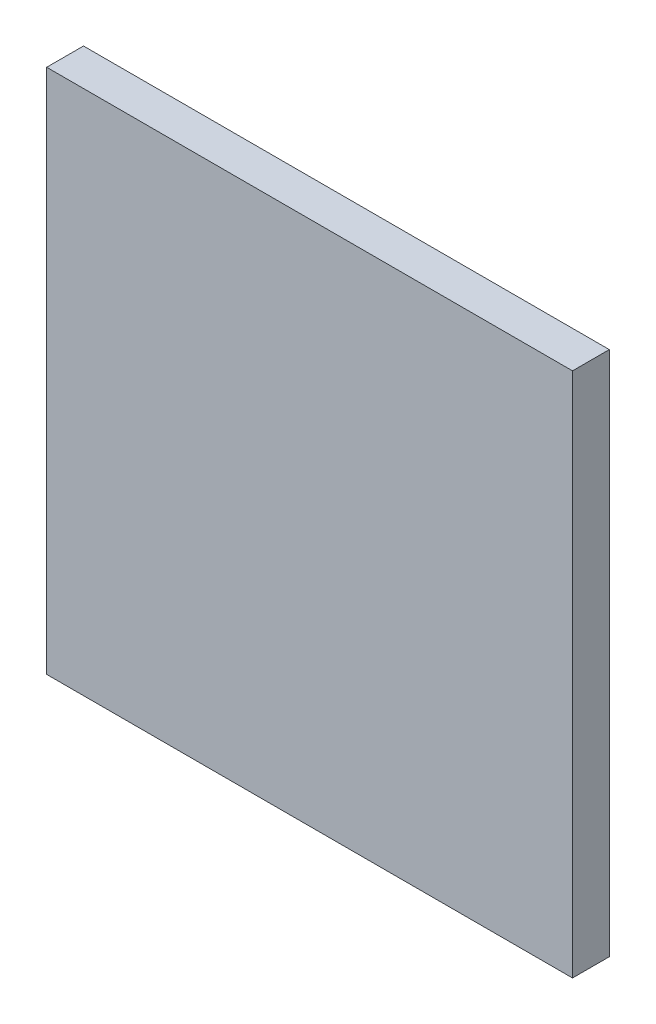
ISO-10303-21;
HEADER;
FILE_DESCRIPTION(('STEP AP214'),'2;1');
FILE_NAME('part.step','',(''),(''),'','','');
FILE_SCHEMA(('AUTOMOTIVE_DESIGN { 1 0 10303 214 1 1 1 1 }'));
ENDSEC;
DATA;
#1=APPLICATION_CONTEXT('core data for automotive mechanical design processes');
#2=APPLICATION_PROTOCOL_DEFINITION('international standard','automotive_design',2000,#1);
#3=PRODUCT_CONTEXT('',#1,'mechanical');
#4=PRODUCT('Part','Part','',(#3));
#5=PRODUCT_RELATED_PRODUCT_CATEGORY('part','',(#4));
#6=PRODUCT_DEFINITION_FORMATION('','',#4);
#7=PRODUCT_DEFINITION_CONTEXT('part definition',#1,'design');
#8=PRODUCT_DEFINITION('design','',#6,#7);
#9=PRODUCT_DEFINITION_SHAPE('','',#8);
#10=(LENGTH_UNIT() NAMED_UNIT(*) SI_UNIT(.MILLI.,.METRE.));
#11=(NAMED_UNIT(*) PLANE_ANGLE_UNIT() SI_UNIT($,.RADIAN.));
#12=(NAMED_UNIT(*) SI_UNIT($,.STERADIAN.) SOLID_ANGLE_UNIT());
#13=UNCERTAINTY_MEASURE_WITH_UNIT(LENGTH_MEASURE(1.E-05),#10,'distance_accuracy_value','');
#14=(GEOMETRIC_REPRESENTATION_CONTEXT(3) GLOBAL_UNCERTAINTY_ASSIGNED_CONTEXT((#13)) GLOBAL_UNIT_ASSIGNED_CONTEXT((#10,
#11,#12)) REPRESENTATION_CONTEXT('',''));
#15=CARTESIAN_POINT('',(0.,0.,0.));
#16=DIRECTION('',(0.,0.,1.));
#17=DIRECTION('',(1.,0.,0.));
#18=AXIS2_PLACEMENT_3D('',#15,#16,#17);
#19=CARTESIAN_POINT('',(25.,25.,3.5));
#20=DIRECTION('',(-1.,0.,0.));
#21=DIRECTION('',(0.,-1.,0.));
#22=AXIS2_PLACEMENT_3D('',#19,#20,#21);
#23=PLANE('',#22);
#24=DIRECTION('',(0.,1.,0.));
#25=VECTOR('',#24,1.);
#26=CARTESIAN_POINT('',(25.,25.,0.));
#27=LINE('',#26,#25);
#28=CARTESIAN_POINT('',(25.,-25.,0.));
#29=VERTEX_POINT('',#28);
#30=CARTESIAN_POINT('',(25.,25.,0.));
#31=VERTEX_POINT('',#30);
#32=EDGE_CURVE('E99',#29,#31,#27,.T.);
#33=ORIENTED_EDGE('',*,*,#32,.T.);
#34=DIRECTION('',(0.,0.,-1.));
#35=VECTOR('',#34,1.);
#36=CARTESIAN_POINT('',(25.,25.,3.5));
#37=LINE('',#36,#35);
#38=CARTESIAN_POINT('',(25.,25.,3.5));
#39=VERTEX_POINT('',#38);
#40=EDGE_CURVE('E11',#39,#31,#37,.T.);
#41=ORIENTED_EDGE('',*,*,#40,.F.);
#42=DIRECTION('',(0.,1.,0.));
#43=VECTOR('',#42,1.);
#44=CARTESIAN_POINT('',(25.,25.,3.5));
#45=LINE('',#44,#43);
#46=CARTESIAN_POINT('',(25.,-25.,3.5));
#47=VERTEX_POINT('',#46);
#48=EDGE_CURVE('E87',#47,#39,#45,.T.);
#49=ORIENTED_EDGE('',*,*,#48,.F.);
#50=DIRECTION('',(0.,0.,-1.));
#51=VECTOR('',#50,1.);
#52=CARTESIAN_POINT('',(25.,-25.,3.5));
#53=LINE('',#52,#51);
#54=EDGE_CURVE('E95',#47,#29,#53,.T.);
#55=ORIENTED_EDGE('',*,*,#54,.T.);
#56=EDGE_LOOP('',(#33,#41,#49,#55));
#57=FACE_BOUND('',#56,.T.);
#58=ADVANCED_FACE('F36',(#57),#23,.F.);
#59=CARTESIAN_POINT('',(-25.,25.,3.5));
#60=DIRECTION('',(0.,-1.,0.));
#61=DIRECTION('',(0.,0.,-1.));
#62=AXIS2_PLACEMENT_3D('',#59,#60,#61);
#63=PLANE('',#62);
#64=DIRECTION('',(-1.,0.,0.));
#65=VECTOR('',#64,1.);
#66=CARTESIAN_POINT('',(-25.,25.,0.));
#67=LINE('',#66,#65);
#68=CARTESIAN_POINT('',(-25.,25.,0.));
#69=VERTEX_POINT('',#68);
#70=EDGE_CURVE('E91',#31,#69,#67,.T.);
#71=ORIENTED_EDGE('',*,*,#70,.T.);
#72=DIRECTION('',(0.,0.,-1.));
#73=VECTOR('',#72,1.);
#74=CARTESIAN_POINT('',(-25.,25.,3.5));
#75=LINE('',#74,#73);
#76=CARTESIAN_POINT('',(-25.,25.,3.5));
#77=VERTEX_POINT('',#76);
#78=EDGE_CURVE('E44',#77,#69,#75,.T.);
#79=ORIENTED_EDGE('',*,*,#78,.F.);
#80=DIRECTION('',(-1.,0.,0.));
#81=VECTOR('',#80,1.);
#82=CARTESIAN_POINT('',(-25.,25.,3.5));
#83=LINE('',#82,#81);
#84=EDGE_CURVE('E82',#39,#77,#83,.T.);
#85=ORIENTED_EDGE('',*,*,#84,.F.);
#86=ORIENTED_EDGE('',*,*,#40,.T.);
#87=EDGE_LOOP('',(#71,#79,#85,#86));
#88=FACE_BOUND('',#87,.T.);
#89=ADVANCED_FACE('F90',(#88),#63,.F.);
#90=CARTESIAN_POINT('',(-25.,25.,3.5));
#91=DIRECTION('',(1.,0.,0.));
#92=DIRECTION('',(0.,1.,0.));
#93=AXIS2_PLACEMENT_3D('',#90,#91,#92);
#94=PLANE('',#93);
#95=DIRECTION('',(0.,-1.,0.));
#96=VECTOR('',#95,1.);
#97=CARTESIAN_POINT('',(-25.,25.,0.));
#98=LINE('',#97,#96);
#99=CARTESIAN_POINT('',(-25.,-25.,0.));
#100=VERTEX_POINT('',#99);
#101=EDGE_CURVE('E69',#69,#100,#98,.T.);
#102=ORIENTED_EDGE('',*,*,#101,.T.);
#103=DIRECTION('',(0.,0.,-1.));
#104=VECTOR('',#103,1.);
#105=CARTESIAN_POINT('',(-25.,-25.,3.5));
#106=LINE('',#105,#104);
#107=CARTESIAN_POINT('',(-25.,-25.,3.5));
#108=VERTEX_POINT('',#107);
#109=EDGE_CURVE('E92',#108,#100,#106,.T.);
#110=ORIENTED_EDGE('',*,*,#109,.F.);
#111=DIRECTION('',(0.,-1.,0.));
#112=VECTOR('',#111,1.);
#113=CARTESIAN_POINT('',(-25.,25.,3.5));
#114=LINE('',#113,#112);
#115=EDGE_CURVE('E85',#77,#108,#114,.T.);
#116=ORIENTED_EDGE('',*,*,#115,.F.);
#117=ORIENTED_EDGE('',*,*,#78,.T.);
#118=EDGE_LOOP('',(#102,#110,#116,#117));
#119=FACE_BOUND('',#118,.T.);
#120=ADVANCED_FACE('F93',(#119),#94,.F.);
#121=CARTESIAN_POINT('',(-25.,-25.,3.5));
#122=DIRECTION('',(0.,1.,0.));
#123=DIRECTION('',(0.,0.,1.));
#124=AXIS2_PLACEMENT_3D('',#121,#122,#123);
#125=PLANE('',#124);
#126=DIRECTION('',(1.,0.,0.));
#127=VECTOR('',#126,1.);
#128=CARTESIAN_POINT('',(-25.,-25.,0.));
#129=LINE('',#128,#127);
#130=EDGE_CURVE('E75',#100,#29,#129,.T.);
#131=ORIENTED_EDGE('',*,*,#130,.T.);
#132=ORIENTED_EDGE('',*,*,#54,.F.);
#133=DIRECTION('',(1.,0.,0.));
#134=VECTOR('',#133,1.);
#135=CARTESIAN_POINT('',(-25.,-25.,3.5));
#136=LINE('',#135,#134);
#137=EDGE_CURVE('E52',#108,#47,#136,.T.);
#138=ORIENTED_EDGE('',*,*,#137,.F.);
#139=ORIENTED_EDGE('',*,*,#109,.T.);
#140=EDGE_LOOP('',(#131,#132,#138,#139));
#141=FACE_BOUND('',#140,.T.);
#142=ADVANCED_FACE('F106',(#141),#125,.F.);
#143=CARTESIAN_POINT('',(0.,0.,3.5));
#144=DIRECTION('',(0.,0.,1.));
#145=DIRECTION('',(1.,0.,0.));
#146=AXIS2_PLACEMENT_3D('',#143,#144,#145);
#147=PLANE('',#146);
#148=ORIENTED_EDGE('',*,*,#48,.T.);
#149=ORIENTED_EDGE('',*,*,#84,.T.);
#150=ORIENTED_EDGE('',*,*,#115,.T.);
#151=ORIENTED_EDGE('',*,*,#137,.T.);
#152=EDGE_LOOP('',(#148,#149,#150,#151));
#153=FACE_BOUND('',#152,.T.);
#154=ADVANCED_FACE('F83',(#153),#147,.T.);
#155=CARTESIAN_POINT('',(0.,0.,0.));
#156=DIRECTION('',(0.,0.,1.));
#157=DIRECTION('',(1.,0.,0.));
#158=AXIS2_PLACEMENT_3D('',#155,#156,#157);
#159=PLANE('',#158);
#160=ORIENTED_EDGE('',*,*,#32,.F.);
#161=ORIENTED_EDGE('',*,*,#130,.F.);
#162=ORIENTED_EDGE('',*,*,#101,.F.);
#163=ORIENTED_EDGE('',*,*,#70,.F.);
#164=EDGE_LOOP('',(#160,#161,#162,#163));
#165=FACE_BOUND('',#164,.T.);
#166=ADVANCED_FACE('F109',(#165),#159,.F.);
#167=CLOSED_SHELL('',(#58,#89,#120,#142,#154,#166));
#168=MANIFOLD_SOLID_BREP('B2',#167);
#169=ADVANCED_BREP_SHAPE_REPRESENTATION('',(#18,#168),#14);
#170=SHAPE_DEFINITION_REPRESENTATION(#9,#169);
ENDSEC;
END-ISO-10303-21;
